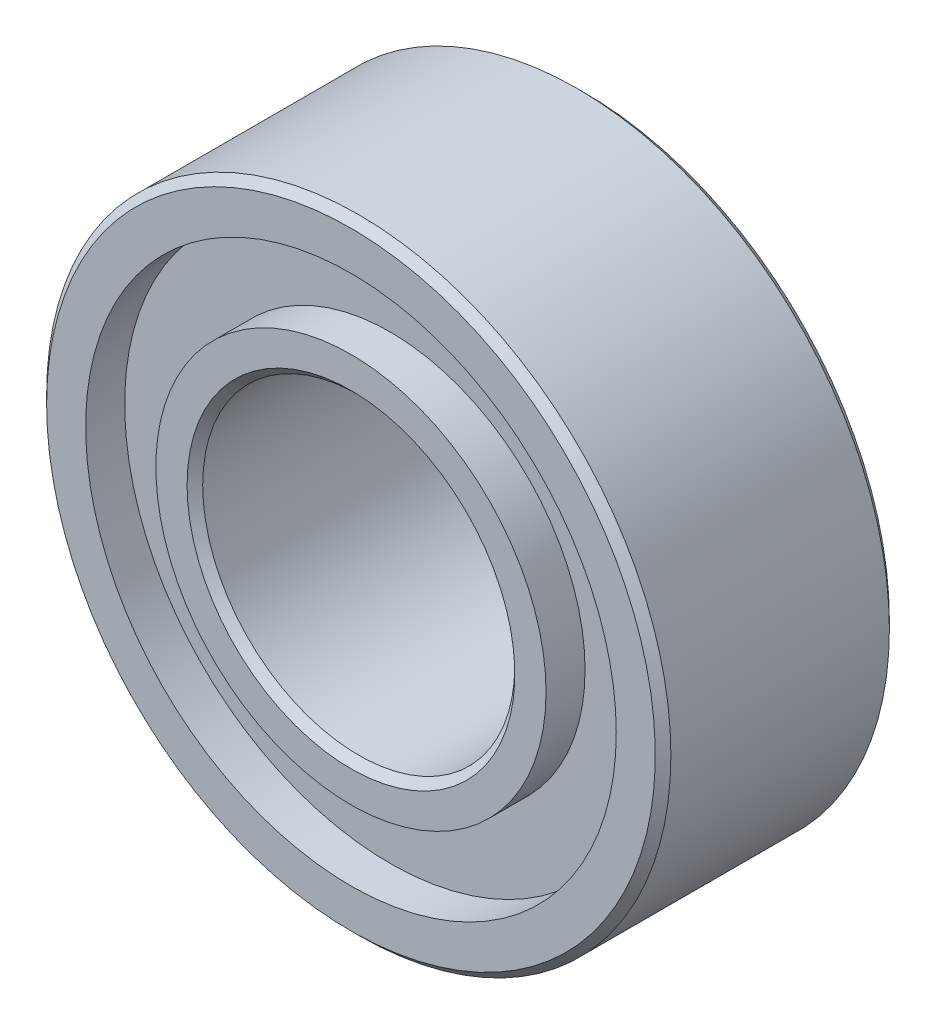
ISO-10303-21;
HEADER;
FILE_DESCRIPTION(('STEP AP214'),'2;1');
FILE_NAME('part.step','',(''),(''),'','','');
FILE_SCHEMA(('AUTOMOTIVE_DESIGN { 1 0 10303 214 1 1 1 1 }'));
ENDSEC;
DATA;
#1=APPLICATION_CONTEXT('core data for automotive mechanical design processes');
#2=APPLICATION_PROTOCOL_DEFINITION('international standard','automotive_design',2000,#1);
#3=PRODUCT_CONTEXT('',#1,'mechanical');
#4=PRODUCT('Part','Part','',(#3));
#5=PRODUCT_RELATED_PRODUCT_CATEGORY('part','',(#4));
#6=PRODUCT_DEFINITION_FORMATION('','',#4);
#7=PRODUCT_DEFINITION_CONTEXT('part definition',#1,'design');
#8=PRODUCT_DEFINITION('design','',#6,#7);
#9=PRODUCT_DEFINITION_SHAPE('','',#8);
#10=(LENGTH_UNIT() NAMED_UNIT(*) SI_UNIT(.MILLI.,.METRE.));
#11=(NAMED_UNIT(*) PLANE_ANGLE_UNIT() SI_UNIT($,.RADIAN.));
#12=(NAMED_UNIT(*) SI_UNIT($,.STERADIAN.) SOLID_ANGLE_UNIT());
#13=UNCERTAINTY_MEASURE_WITH_UNIT(LENGTH_MEASURE(1.E-05),#10,'distance_accuracy_value','');
#14=(GEOMETRIC_REPRESENTATION_CONTEXT(3) GLOBAL_UNCERTAINTY_ASSIGNED_CONTEXT((#13)) GLOBAL_UNIT_ASSIGNED_CONTEXT((#10,
#11,#12)) REPRESENTATION_CONTEXT('',''));
#15=CARTESIAN_POINT('',(0.,0.,0.));
#16=DIRECTION('',(0.,0.,1.));
#17=DIRECTION('',(1.,0.,0.));
#18=AXIS2_PLACEMENT_3D('',#15,#16,#17);
#19=CARTESIAN_POINT('',(0.,2.,-1.5));
#20=DIRECTION('',(0.,0.,1.));
#21=DIRECTION('',(1.,0.,0.));
#22=AXIS2_PLACEMENT_3D('',#19,#20,#21);
#23=PLANE('',#22);
#24=CARTESIAN_POINT('',(0.,0.,-1.5));
#25=DIRECTION('',(0.,0.,1.));
#26=DIRECTION('',(1.,0.,0.));
#27=AXIS2_PLACEMENT_3D('',#24,#25,#26);
#28=CIRCLE('',#27,2.1);
#29=CARTESIAN_POINT('',(2.1,0.,-1.5));
#30=VERTEX_POINT('',#29);
#31=EDGE_CURVE('E66',#30,#30,#28,.T.);
#32=ORIENTED_EDGE('',*,*,#31,.T.);
#33=EDGE_LOOP('',(#32));
#34=FACE_BOUND('',#33,.T.);
#35=CARTESIAN_POINT('',(0.,0.,-1.5));
#36=DIRECTION('',(0.,0.,1.));
#37=DIRECTION('',(1.,0.,0.));
#38=AXIS2_PLACEMENT_3D('',#35,#36,#37);
#39=CIRCLE('',#38,2.5);
#40=CARTESIAN_POINT('',(2.5,0.,-1.5));
#41=VERTEX_POINT('',#40);
#42=EDGE_CURVE('E69',#41,#41,#39,.T.);
#43=ORIENTED_EDGE('',*,*,#42,.F.);
#44=EDGE_LOOP('',(#43));
#45=FACE_BOUND('',#44,.T.);
#46=ADVANCED_FACE('F37',(#34,#45),#23,.F.);
#47=CARTESIAN_POINT('',(0.,0.,11.8458465216965));
#48=DIRECTION('',(0.,0.,1.));
#49=DIRECTION('',(1.,0.,0.));
#50=AXIS2_PLACEMENT_3D('',#47,#48,#49);
#51=CYLINDRICAL_SURFACE('',#50,2.5);
#52=CARTESIAN_POINT('',(0.,0.,-1.));
#53=DIRECTION('',(0.,0.,1.));
#54=DIRECTION('',(1.,0.,0.));
#55=AXIS2_PLACEMENT_3D('',#52,#53,#54);
#56=CIRCLE('',#55,2.5);
#57=CARTESIAN_POINT('',(2.5,0.,-1.));
#58=VERTEX_POINT('',#57);
#59=EDGE_CURVE('E72',#58,#58,#56,.T.);
#60=ORIENTED_EDGE('',*,*,#59,.F.);
#61=EDGE_LOOP('',(#60));
#62=FACE_BOUND('',#61,.T.);
#63=ORIENTED_EDGE('',*,*,#42,.T.);
#64=EDGE_LOOP('',(#63));
#65=FACE_BOUND('',#64,.T.);
#66=ADVANCED_FACE('F125',(#62,#65),#51,.T.);
#67=CARTESIAN_POINT('',(0.,2.5,-1.));
#68=DIRECTION('',(0.,0.,1.));
#69=DIRECTION('',(1.,0.,0.));
#70=AXIS2_PLACEMENT_3D('',#67,#68,#69);
#71=PLANE('',#70);
#72=CARTESIAN_POINT('',(0.,0.,-1.));
#73=DIRECTION('',(0.,0.,1.));
#74=DIRECTION('',(1.,0.,0.));
#75=AXIS2_PLACEMENT_3D('',#72,#73,#74);
#76=CIRCLE('',#75,3.4);
#77=CARTESIAN_POINT('',(3.4,0.,-1.));
#78=VERTEX_POINT('',#77);
#79=EDGE_CURVE('E75',#78,#78,#76,.T.);
#80=ORIENTED_EDGE('',*,*,#79,.F.);
#81=EDGE_LOOP('',(#80));
#82=FACE_BOUND('',#81,.T.);
#83=ORIENTED_EDGE('',*,*,#59,.T.);
#84=EDGE_LOOP('',(#83));
#85=FACE_BOUND('',#84,.T.);
#86=ADVANCED_FACE('F131',(#82,#85),#71,.F.);
#87=CARTESIAN_POINT('',(0.,0.,11.8458465216965));
#88=DIRECTION('',(0.,0.,1.));
#89=DIRECTION('',(1.,0.,0.));
#90=AXIS2_PLACEMENT_3D('',#87,#88,#89);
#91=CYLINDRICAL_SURFACE('',#90,3.4);
#92=CARTESIAN_POINT('',(0.,0.,-1.5));
#93=DIRECTION('',(0.,0.,1.));
#94=DIRECTION('',(1.,0.,0.));
#95=AXIS2_PLACEMENT_3D('',#92,#93,#94);
#96=CIRCLE('',#95,3.4);
#97=CARTESIAN_POINT('',(3.4,0.,-1.5));
#98=VERTEX_POINT('',#97);
#99=EDGE_CURVE('E78',#98,#98,#96,.T.);
#100=ORIENTED_EDGE('',*,*,#99,.F.);
#101=EDGE_LOOP('',(#100));
#102=FACE_BOUND('',#101,.T.);
#103=ORIENTED_EDGE('',*,*,#79,.T.);
#104=EDGE_LOOP('',(#103));
#105=FACE_BOUND('',#104,.T.);
#106=ADVANCED_FACE('F221',(#102,#105),#91,.F.);
#107=CARTESIAN_POINT('',(0.,3.4,-1.5));
#108=DIRECTION('',(0.,0.,1.));
#109=DIRECTION('',(1.,0.,0.));
#110=AXIS2_PLACEMENT_3D('',#107,#108,#109);
#111=PLANE('',#110);
#112=CARTESIAN_POINT('',(0.,0.,-1.5));
#113=DIRECTION('',(0.,0.,1.));
#114=DIRECTION('',(1.,0.,0.));
#115=AXIS2_PLACEMENT_3D('',#112,#113,#114);
#116=CIRCLE('',#115,3.9);
#117=CARTESIAN_POINT('',(3.9,0.,-1.5));
#118=VERTEX_POINT('',#117);
#119=EDGE_CURVE('E44',#118,#118,#116,.F.);
#120=ORIENTED_EDGE('',*,*,#119,.T.);
#121=EDGE_LOOP('',(#120));
#122=FACE_BOUND('',#121,.T.);
#123=ORIENTED_EDGE('',*,*,#99,.T.);
#124=EDGE_LOOP('',(#123));
#125=FACE_BOUND('',#124,.T.);
#126=ADVANCED_FACE('F121',(#122,#125),#111,.F.);
#127=CARTESIAN_POINT('',(0.,0.,11.8458465216965));
#128=DIRECTION('',(0.,0.,1.));
#129=DIRECTION('',(1.,0.,0.));
#130=AXIS2_PLACEMENT_3D('',#127,#128,#129);
#131=CYLINDRICAL_SURFACE('',#130,4.);
#132=CARTESIAN_POINT('',(0.,0.,-1.4));
#133=DIRECTION('',(0.,0.,1.));
#134=DIRECTION('',(1.,0.,0.));
#135=AXIS2_PLACEMENT_3D('',#132,#133,#134);
#136=CIRCLE('',#135,4.);
#137=CARTESIAN_POINT('',(4.,0.,-1.4));
#138=VERTEX_POINT('',#137);
#139=EDGE_CURVE('E48',#138,#138,#136,.T.);
#140=ORIENTED_EDGE('',*,*,#139,.T.);
#141=EDGE_LOOP('',(#140));
#142=FACE_BOUND('',#141,.T.);
#143=CARTESIAN_POINT('',(0.,0.,1.4));
#144=DIRECTION('',(0.,0.,-1.));
#145=DIRECTION('',(-1.,0.,0.));
#146=AXIS2_PLACEMENT_3D('',#143,#144,#145);
#147=CIRCLE('',#146,4.);
#148=CARTESIAN_POINT('',(-4.,0.,1.4));
#149=VERTEX_POINT('',#148);
#150=EDGE_CURVE('E52',#149,#149,#147,.T.);
#151=ORIENTED_EDGE('',*,*,#150,.T.);
#152=EDGE_LOOP('',(#151));
#153=FACE_BOUND('',#152,.T.);
#154=ADVANCED_FACE('F116',(#142,#153),#131,.T.);
#155=CARTESIAN_POINT('',(0.,3.4,1.5));
#156=DIRECTION('',(0.,0.,-1.));
#157=DIRECTION('',(-1.,0.,0.));
#158=AXIS2_PLACEMENT_3D('',#155,#156,#157);
#159=PLANE('',#158);
#160=CARTESIAN_POINT('',(0.,0.,1.5));
#161=DIRECTION('',(0.,0.,-1.));
#162=DIRECTION('',(-1.,0.,0.));
#163=AXIS2_PLACEMENT_3D('',#160,#161,#162);
#164=CIRCLE('',#163,3.9);
#165=CARTESIAN_POINT('',(-3.9,0.,1.5));
#166=VERTEX_POINT('',#165);
#167=EDGE_CURVE('E10',#166,#166,#164,.F.);
#168=ORIENTED_EDGE('',*,*,#167,.T.);
#169=EDGE_LOOP('',(#168));
#170=FACE_BOUND('',#169,.T.);
#171=CARTESIAN_POINT('',(0.,0.,1.5));
#172=DIRECTION('',(0.,0.,1.));
#173=DIRECTION('',(1.,0.,0.));
#174=AXIS2_PLACEMENT_3D('',#171,#172,#173);
#175=CIRCLE('',#174,3.4);
#176=CARTESIAN_POINT('',(3.4,0.,1.5));
#177=VERTEX_POINT('',#176);
#178=EDGE_CURVE('E81',#177,#177,#175,.T.);
#179=ORIENTED_EDGE('',*,*,#178,.F.);
#180=EDGE_LOOP('',(#179));
#181=FACE_BOUND('',#180,.T.);
#182=ADVANCED_FACE('F111',(#170,#181),#159,.F.);
#183=CARTESIAN_POINT('',(0.,0.,11.8458465216965));
#184=DIRECTION('',(0.,0.,1.));
#185=DIRECTION('',(1.,0.,0.));
#186=AXIS2_PLACEMENT_3D('',#183,#184,#185);
#187=CYLINDRICAL_SURFACE('',#186,3.4);
#188=CARTESIAN_POINT('',(0.,0.,0.999999999999999));
#189=DIRECTION('',(0.,0.,1.));
#190=DIRECTION('',(1.,0.,0.));
#191=AXIS2_PLACEMENT_3D('',#188,#189,#190);
#192=CIRCLE('',#191,3.4);
#193=CARTESIAN_POINT('',(3.4,0.,0.999999999999999));
#194=VERTEX_POINT('',#193);
#195=EDGE_CURVE('E84',#194,#194,#192,.T.);
#196=ORIENTED_EDGE('',*,*,#195,.F.);
#197=EDGE_LOOP('',(#196));
#198=FACE_BOUND('',#197,.T.);
#199=ORIENTED_EDGE('',*,*,#178,.T.);
#200=EDGE_LOOP('',(#199));
#201=FACE_BOUND('',#200,.T.);
#202=ADVANCED_FACE('F105',(#198,#201),#187,.F.);
#203=CARTESIAN_POINT('',(0.,2.5,0.999999999999999));
#204=DIRECTION('',(0.,0.,-1.));
#205=DIRECTION('',(-1.,0.,0.));
#206=AXIS2_PLACEMENT_3D('',#203,#204,#205);
#207=PLANE('',#206);
#208=CARTESIAN_POINT('',(0.,0.,0.999999999999999));
#209=DIRECTION('',(0.,0.,1.));
#210=DIRECTION('',(1.,0.,0.));
#211=AXIS2_PLACEMENT_3D('',#208,#209,#210);
#212=CIRCLE('',#211,2.5);
#213=CARTESIAN_POINT('',(2.5,0.,0.999999999999999));
#214=VERTEX_POINT('',#213);
#215=EDGE_CURVE('E87',#214,#214,#212,.T.);
#216=ORIENTED_EDGE('',*,*,#215,.F.);
#217=EDGE_LOOP('',(#216));
#218=FACE_BOUND('',#217,.T.);
#219=ORIENTED_EDGE('',*,*,#195,.T.);
#220=EDGE_LOOP('',(#219));
#221=FACE_BOUND('',#220,.T.);
#222=ADVANCED_FACE('F99',(#218,#221),#207,.F.);
#223=CARTESIAN_POINT('',(0.,0.,11.8458465216965));
#224=DIRECTION('',(0.,0.,1.));
#225=DIRECTION('',(1.,0.,0.));
#226=AXIS2_PLACEMENT_3D('',#223,#224,#225);
#227=CYLINDRICAL_SURFACE('',#226,2.5);
#228=CARTESIAN_POINT('',(0.,0.,1.5));
#229=DIRECTION('',(0.,0.,1.));
#230=DIRECTION('',(1.,0.,0.));
#231=AXIS2_PLACEMENT_3D('',#228,#229,#230);
#232=CIRCLE('',#231,2.5);
#233=CARTESIAN_POINT('',(2.5,0.,1.5));
#234=VERTEX_POINT('',#233);
#235=EDGE_CURVE('E90',#234,#234,#232,.T.);
#236=ORIENTED_EDGE('',*,*,#235,.F.);
#237=EDGE_LOOP('',(#236));
#238=FACE_BOUND('',#237,.T.);
#239=ORIENTED_EDGE('',*,*,#215,.T.);
#240=EDGE_LOOP('',(#239));
#241=FACE_BOUND('',#240,.T.);
#242=ADVANCED_FACE('F96',(#238,#241),#227,.T.);
#243=CARTESIAN_POINT('',(0.,2.,1.5));
#244=DIRECTION('',(0.,0.,-1.));
#245=DIRECTION('',(-1.,0.,0.));
#246=AXIS2_PLACEMENT_3D('',#243,#244,#245);
#247=PLANE('',#246);
#248=CARTESIAN_POINT('',(0.,0.,1.5));
#249=DIRECTION('',(0.,0.,-1.));
#250=DIRECTION('',(-1.,0.,0.));
#251=AXIS2_PLACEMENT_3D('',#248,#249,#250);
#252=CIRCLE('',#251,2.1);
#253=CARTESIAN_POINT('',(-2.1,0.,1.5));
#254=VERTEX_POINT('',#253);
#255=EDGE_CURVE('E57',#254,#254,#252,.T.);
#256=ORIENTED_EDGE('',*,*,#255,.T.);
#257=EDGE_LOOP('',(#256));
#258=FACE_BOUND('',#257,.T.);
#259=ORIENTED_EDGE('',*,*,#235,.T.);
#260=EDGE_LOOP('',(#259));
#261=FACE_BOUND('',#260,.T.);
#262=ADVANCED_FACE('F94',(#258,#261),#247,.F.);
#263=CARTESIAN_POINT('',(0.,0.,11.8458465216965));
#264=DIRECTION('',(0.,0.,1.));
#265=DIRECTION('',(1.,0.,0.));
#266=AXIS2_PLACEMENT_3D('',#263,#264,#265);
#267=CYLINDRICAL_SURFACE('',#266,2.);
#268=CARTESIAN_POINT('',(0.,0.,-1.4));
#269=DIRECTION('',(0.,0.,1.));
#270=DIRECTION('',(1.,0.,0.));
#271=AXIS2_PLACEMENT_3D('',#268,#269,#270);
#272=CIRCLE('',#271,2.);
#273=CARTESIAN_POINT('',(2.,0.,-1.4));
#274=VERTEX_POINT('',#273);
#275=EDGE_CURVE('E60',#274,#274,#272,.F.);
#276=ORIENTED_EDGE('',*,*,#275,.T.);
#277=EDGE_LOOP('',(#276));
#278=FACE_BOUND('',#277,.T.);
#279=CARTESIAN_POINT('',(0.,0.,1.4));
#280=DIRECTION('',(0.,0.,-1.));
#281=DIRECTION('',(-1.,0.,0.));
#282=AXIS2_PLACEMENT_3D('',#279,#280,#281);
#283=CIRCLE('',#282,2.);
#284=CARTESIAN_POINT('',(-2.,0.,1.4));
#285=VERTEX_POINT('',#284);
#286=EDGE_CURVE('E63',#285,#285,#283,.F.);
#287=ORIENTED_EDGE('',*,*,#286,.T.);
#288=EDGE_LOOP('',(#287));
#289=FACE_BOUND('',#288,.T.);
#290=ADVANCED_FACE('F141',(#278,#289),#267,.F.);
#291=CARTESIAN_POINT('',(0.,0.,-1.5));
#292=DIRECTION('',(0.,0.,-1.));
#293=DIRECTION('',(-1.,0.,0.));
#294=AXIS2_PLACEMENT_3D('',#291,#292,#293);
#295=CONICAL_SURFACE('',#294,2.1,0.785398163397453);
#296=ORIENTED_EDGE('',*,*,#275,.F.);
#297=EDGE_LOOP('',(#296));
#298=FACE_BOUND('',#297,.T.);
#299=ORIENTED_EDGE('',*,*,#31,.F.);
#300=EDGE_LOOP('',(#299));
#301=FACE_BOUND('',#300,.T.);
#302=ADVANCED_FACE('F137',(#298,#301),#295,.F.);
#303=CARTESIAN_POINT('',(0.,0.,1.4));
#304=DIRECTION('',(0.,0.,1.));
#305=DIRECTION('',(1.,0.,0.));
#306=AXIS2_PLACEMENT_3D('',#303,#304,#305);
#307=CONICAL_SURFACE('',#306,2.,0.785398163397461);
#308=ORIENTED_EDGE('',*,*,#255,.F.);
#309=EDGE_LOOP('',(#308));
#310=FACE_BOUND('',#309,.T.);
#311=ORIENTED_EDGE('',*,*,#286,.F.);
#312=EDGE_LOOP('',(#311));
#313=FACE_BOUND('',#312,.T.);
#314=ADVANCED_FACE('F140',(#310,#313),#307,.F.);
#315=CARTESIAN_POINT('',(0.,0.,-1.4));
#316=DIRECTION('',(0.,0.,1.));
#317=DIRECTION('',(1.,0.,0.));
#318=AXIS2_PLACEMENT_3D('',#315,#316,#317);
#319=CONICAL_SURFACE('',#318,4.,0.785398163397461);
#320=ORIENTED_EDGE('',*,*,#119,.F.);
#321=EDGE_LOOP('',(#320));
#322=FACE_BOUND('',#321,.T.);
#323=ORIENTED_EDGE('',*,*,#139,.F.);
#324=EDGE_LOOP('',(#323));
#325=FACE_BOUND('',#324,.T.);
#326=ADVANCED_FACE('F144',(#322,#325),#319,.T.);
#327=CARTESIAN_POINT('',(0.,0.,1.5));
#328=DIRECTION('',(0.,0.,-1.));
#329=DIRECTION('',(-1.,0.,0.));
#330=AXIS2_PLACEMENT_3D('',#327,#328,#329);
#331=CONICAL_SURFACE('',#330,3.9,0.785398163397457);
#332=ORIENTED_EDGE('',*,*,#150,.F.);
#333=EDGE_LOOP('',(#332));
#334=FACE_BOUND('',#333,.T.);
#335=ORIENTED_EDGE('',*,*,#167,.F.);
#336=EDGE_LOOP('',(#335));
#337=FACE_BOUND('',#336,.T.);
#338=ADVANCED_FACE('F39',(#334,#337),#331,.T.);
#339=CLOSED_SHELL('',(#46,#66,#86,#106,#126,#154,#182,#202,#222,#242,#262,#290,#302,#314,#326,#338));
#340=MANIFOLD_SOLID_BREP('B2',#339);
#341=ADVANCED_BREP_SHAPE_REPRESENTATION('',(#18,#340),#14);
#342=SHAPE_DEFINITION_REPRESENTATION(#9,#341);
ENDSEC;
END-ISO-10303-21;
